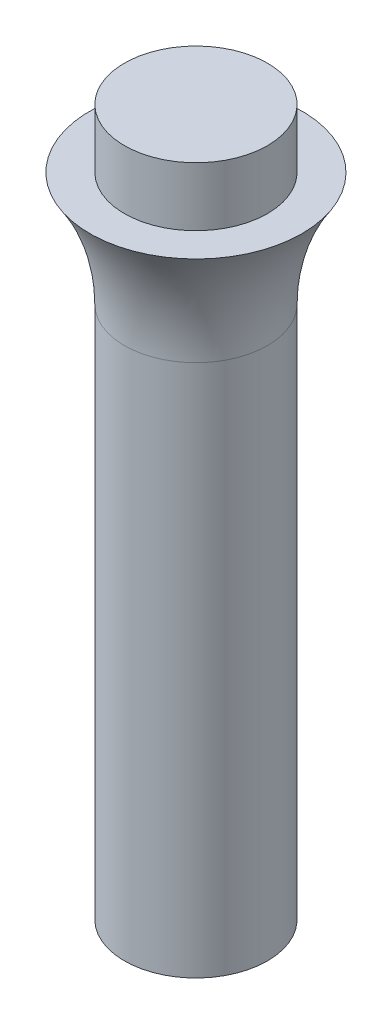
ISO-10303-21;
HEADER;
FILE_DESCRIPTION(('STEP AP214'),'2;1');
FILE_NAME('part.step','',(''),(''),'','','');
FILE_SCHEMA(('AUTOMOTIVE_DESIGN { 1 0 10303 214 1 1 1 1 }'));
ENDSEC;
DATA;
#1=APPLICATION_CONTEXT('core data for automotive mechanical design processes');
#2=APPLICATION_PROTOCOL_DEFINITION('international standard','automotive_design',2000,#1);
#3=PRODUCT_CONTEXT('',#1,'mechanical');
#4=PRODUCT('Part','Part','',(#3));
#5=PRODUCT_RELATED_PRODUCT_CATEGORY('part','',(#4));
#6=PRODUCT_DEFINITION_FORMATION('','',#4);
#7=PRODUCT_DEFINITION_CONTEXT('part definition',#1,'design');
#8=PRODUCT_DEFINITION('design','',#6,#7);
#9=PRODUCT_DEFINITION_SHAPE('','',#8);
#10=(LENGTH_UNIT() NAMED_UNIT(*) SI_UNIT(.MILLI.,.METRE.));
#11=(NAMED_UNIT(*) PLANE_ANGLE_UNIT() SI_UNIT($,.RADIAN.));
#12=(NAMED_UNIT(*) SI_UNIT($,.STERADIAN.) SOLID_ANGLE_UNIT());
#13=UNCERTAINTY_MEASURE_WITH_UNIT(LENGTH_MEASURE(1.E-05),#10,'distance_accuracy_value','');
#14=(GEOMETRIC_REPRESENTATION_CONTEXT(3) GLOBAL_UNCERTAINTY_ASSIGNED_CONTEXT((#13)) GLOBAL_UNIT_ASSIGNED_CONTEXT((#10,
#11,#12)) REPRESENTATION_CONTEXT('',''));
#15=CARTESIAN_POINT('',(0.,0.,0.));
#16=DIRECTION('',(0.,0.,1.));
#17=DIRECTION('',(1.,0.,0.));
#18=AXIS2_PLACEMENT_3D('',#15,#16,#17);
#19=CARTESIAN_POINT('',(0.728682558242401,31.9056879853533,0.));
#20=DIRECTION('',(0.,-1.,0.));
#21=DIRECTION('',(1.,0.,0.));
#22=AXIS2_PLACEMENT_3D('',#19,#20,#21);
#23=CYLINDRICAL_SURFACE('',#22,3.1);
#24=CARTESIAN_POINT('',(0.728682558242401,31.9056879853533,0.));
#25=DIRECTION('',(0.,-1.,0.));
#26=DIRECTION('',(1.,0.,0.));
#27=AXIS2_PLACEMENT_3D('',#24,#25,#26);
#28=CIRCLE('',#27,3.1);
#29=CARTESIAN_POINT('',(3.8286825582424,31.9056879853533,0.));
#30=VERTEX_POINT('',#29);
#31=EDGE_CURVE('E56',#30,#30,#28,.T.);
#32=ORIENTED_EDGE('',*,*,#31,.T.);
#33=EDGE_LOOP('',(#32));
#34=FACE_BOUND('',#33,.T.);
#35=CARTESIAN_POINT('',(0.728682558242401,29.3532329465251,0.));
#36=DIRECTION('',(0.,-1.,0.));
#37=DIRECTION('',(1.,0.,0.));
#38=AXIS2_PLACEMENT_3D('',#35,#36,#37);
#39=CIRCLE('',#38,3.1);
#40=CARTESIAN_POINT('',(3.8286825582424,29.3532329465251,0.));
#41=VERTEX_POINT('',#40);
#42=EDGE_CURVE('E10',#41,#41,#39,.T.);
#43=ORIENTED_EDGE('',*,*,#42,.F.);
#44=EDGE_LOOP('',(#43));
#45=FACE_BOUND('',#44,.T.);
#46=ADVANCED_FACE('F31',(#34,#45),#23,.T.);
#47=CARTESIAN_POINT('',(5.3286825582424,29.3532329465251,0.));
#48=DIRECTION('',(0.,1.,0.));
#49=DIRECTION('',(-1.,0.,0.));
#50=AXIS2_PLACEMENT_3D('',#47,#48,#49);
#51=PLANE('',#50);
#52=ORIENTED_EDGE('',*,*,#42,.T.);
#53=EDGE_LOOP('',(#52));
#54=FACE_BOUND('',#53,.T.);
#55=CARTESIAN_POINT('',(0.728682558242401,29.3532329465251,0.));
#56=DIRECTION('',(0.,-1.,0.));
#57=DIRECTION('',(1.,0.,0.));
#58=AXIS2_PLACEMENT_3D('',#55,#56,#57);
#59=CIRCLE('',#58,4.6);
#60=CARTESIAN_POINT('',(5.3286825582424,29.3532329465251,0.));
#61=VERTEX_POINT('',#60);
#62=EDGE_CURVE('E37',#61,#61,#59,.T.);
#63=ORIENTED_EDGE('',*,*,#62,.F.);
#64=EDGE_LOOP('',(#63));
#65=FACE_BOUND('',#64,.T.);
#66=ADVANCED_FACE('F73',(#54,#65),#51,.T.);
#67=CARTESIAN_POINT('',(0.728682558242403,24.3983587899297,0.));
#68=DIRECTION('',(0.,-1.,0.));
#69=DIRECTION('',(1.,0.,0.));
#70=AXIS2_PLACEMENT_3D('',#67,#68,#69);
#71=TOROIDAL_SURFACE('',#70,12.0335926358989,8.93359263589894);
#72=ORIENTED_EDGE('',*,*,#62,.T.);
#73=EDGE_LOOP('',(#72));
#74=FACE_BOUND('',#73,.T.);
#75=CARTESIAN_POINT('',(0.728682558242402,24.3983587899297,0.));
#76=DIRECTION('',(0.,-1.,0.));
#77=DIRECTION('',(1.,0.,0.));
#78=AXIS2_PLACEMENT_3D('',#75,#76,#77);
#79=CIRCLE('',#78,3.1);
#80=CARTESIAN_POINT('',(3.8286825582424,24.3983587899297,0.));
#81=VERTEX_POINT('',#80);
#82=EDGE_CURVE('E41',#81,#81,#79,.T.);
#83=ORIENTED_EDGE('',*,*,#82,.F.);
#84=EDGE_LOOP('',(#83));
#85=FACE_BOUND('',#84,.T.);
#86=ADVANCED_FACE('F77',(#74,#85),#71,.F.);
#87=CARTESIAN_POINT('',(0.728682558242401,31.9056879853533,0.));
#88=DIRECTION('',(0.,-1.,0.));
#89=DIRECTION('',(1.,0.,0.));
#90=AXIS2_PLACEMENT_3D('',#87,#88,#89);
#91=CYLINDRICAL_SURFACE('',#90,3.1);
#92=ORIENTED_EDGE('',*,*,#82,.T.);
#93=EDGE_LOOP('',(#92));
#94=FACE_BOUND('',#93,.T.);
#95=CARTESIAN_POINT('',(0.728682558242405,1.2973382799297,0.));
#96=DIRECTION('',(0.,-1.,0.));
#97=DIRECTION('',(1.,0.,0.));
#98=AXIS2_PLACEMENT_3D('',#95,#96,#97);
#99=CIRCLE('',#98,3.1);
#100=CARTESIAN_POINT('',(3.8286825582424,1.2973382799297,0.));
#101=VERTEX_POINT('',#100);
#102=EDGE_CURVE('E45',#101,#101,#99,.T.);
#103=ORIENTED_EDGE('',*,*,#102,.F.);
#104=EDGE_LOOP('',(#103));
#105=FACE_BOUND('',#104,.T.);
#106=ADVANCED_FACE('F81',(#94,#105),#91,.T.);
#107=CARTESIAN_POINT('',(1.97868255824241,1.2973382799297,0.));
#108=DIRECTION('',(0.,-1.,0.));
#109=DIRECTION('',(1.,0.,0.));
#110=AXIS2_PLACEMENT_3D('',#107,#108,#109);
#111=PLANE('',#110);
#112=ORIENTED_EDGE('',*,*,#102,.T.);
#113=EDGE_LOOP('',(#112));
#114=FACE_BOUND('',#113,.T.);
#115=CARTESIAN_POINT('',(0.728682558242405,1.2973382799297,0.));
#116=DIRECTION('',(0.,-1.,0.));
#117=DIRECTION('',(1.,0.,0.));
#118=AXIS2_PLACEMENT_3D('',#115,#116,#117);
#119=CIRCLE('',#118,1.25);
#120=CARTESIAN_POINT('',(1.97868255824241,1.2973382799297,0.));
#121=VERTEX_POINT('',#120);
#122=EDGE_CURVE('E50',#121,#121,#119,.T.);
#123=ORIENTED_EDGE('',*,*,#122,.F.);
#124=EDGE_LOOP('',(#123));
#125=FACE_BOUND('',#124,.T.);
#126=ADVANCED_FACE('F87',(#114,#125),#111,.T.);
#127=CARTESIAN_POINT('',(0.728682558242401,31.9056879853533,0.));
#128=DIRECTION('',(0.,-1.,0.));
#129=DIRECTION('',(1.,0.,0.));
#130=AXIS2_PLACEMENT_3D('',#127,#128,#129);
#131=CYLINDRICAL_SURFACE('',#130,1.25);
#132=ORIENTED_EDGE('',*,*,#122,.T.);
#133=EDGE_LOOP('',(#132));
#134=FACE_BOUND('',#133,.T.);
#135=CARTESIAN_POINT('',(0.728682558242403,15.2973382799297,0.));
#136=DIRECTION('',(0.,-1.,0.));
#137=DIRECTION('',(1.,0.,0.));
#138=AXIS2_PLACEMENT_3D('',#135,#136,#137);
#139=CIRCLE('',#138,1.25);
#140=CARTESIAN_POINT('',(1.9786825582424,15.2973382799297,0.));
#141=VERTEX_POINT('',#140);
#142=EDGE_CURVE('E53',#141,#141,#139,.T.);
#143=ORIENTED_EDGE('',*,*,#142,.F.);
#144=EDGE_LOOP('',(#143));
#145=FACE_BOUND('',#144,.T.);
#146=ADVANCED_FACE('F69',(#134,#145),#131,.F.);
#147=CARTESIAN_POINT('',(0.728682558242403,15.2973382799297,0.));
#148=DIRECTION('',(0.,-1.,0.));
#149=DIRECTION('',(1.,0.,0.));
#150=AXIS2_PLACEMENT_3D('',#147,#148,#149);
#151=PLANE('',#150);
#152=ORIENTED_EDGE('',*,*,#142,.T.);
#153=EDGE_LOOP('',(#152));
#154=FACE_BOUND('',#153,.T.);
#155=ADVANCED_FACE('F64',(#154),#151,.T.);
#156=CARTESIAN_POINT('',(3.8286825582424,31.9056879853533,0.));
#157=DIRECTION('',(0.,1.,0.));
#158=DIRECTION('',(-1.,0.,0.));
#159=AXIS2_PLACEMENT_3D('',#156,#157,#158);
#160=PLANE('',#159);
#161=ORIENTED_EDGE('',*,*,#31,.F.);
#162=EDGE_LOOP('',(#161));
#163=FACE_BOUND('',#162,.T.);
#164=ADVANCED_FACE('F62',(#163),#160,.T.);
#165=CLOSED_SHELL('',(#46,#66,#86,#106,#126,#146,#155,#164));
#166=MANIFOLD_SOLID_BREP('B2',#165);
#167=ADVANCED_BREP_SHAPE_REPRESENTATION('',(#18,#166),#14);
#168=SHAPE_DEFINITION_REPRESENTATION(#9,#167);
ENDSEC;
END-ISO-10303-21;
